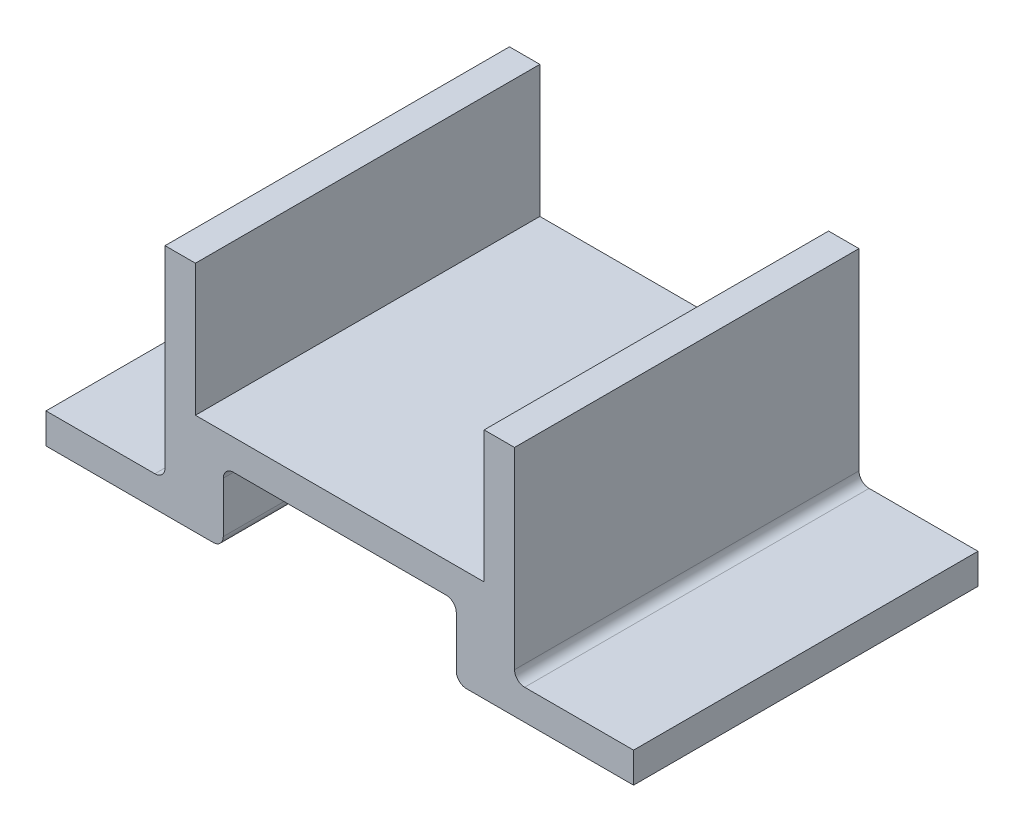
ISO-10303-21;
HEADER;
FILE_DESCRIPTION(('STEP AP214'),'2;1');
FILE_NAME('part.step','',(''),(''),'','','');
FILE_SCHEMA(('AUTOMOTIVE_DESIGN { 1 0 10303 214 1 1 1 1 }'));
ENDSEC;
DATA;
#1=APPLICATION_CONTEXT('core data for automotive mechanical design processes');
#2=APPLICATION_PROTOCOL_DEFINITION('international standard','automotive_design',2000,#1);
#3=PRODUCT_CONTEXT('',#1,'mechanical');
#4=PRODUCT('Part','Part','',(#3));
#5=PRODUCT_RELATED_PRODUCT_CATEGORY('part','',(#4));
#6=PRODUCT_DEFINITION_FORMATION('','',#4);
#7=PRODUCT_DEFINITION_CONTEXT('part definition',#1,'design');
#8=PRODUCT_DEFINITION('design','',#6,#7);
#9=PRODUCT_DEFINITION_SHAPE('','',#8);
#10=(LENGTH_UNIT() NAMED_UNIT(*) SI_UNIT(.MILLI.,.METRE.));
#11=(NAMED_UNIT(*) PLANE_ANGLE_UNIT() SI_UNIT($,.RADIAN.));
#12=(NAMED_UNIT(*) SI_UNIT($,.STERADIAN.) SOLID_ANGLE_UNIT());
#13=UNCERTAINTY_MEASURE_WITH_UNIT(LENGTH_MEASURE(1.E-05),#10,'distance_accuracy_value','');
#14=(GEOMETRIC_REPRESENTATION_CONTEXT(3) GLOBAL_UNCERTAINTY_ASSIGNED_CONTEXT((#13)) GLOBAL_UNIT_ASSIGNED_CONTEXT((#10,
#11,#12)) REPRESENTATION_CONTEXT('',''));
#15=CARTESIAN_POINT('',(0.,0.,0.));
#16=DIRECTION('',(0.,0.,1.));
#17=DIRECTION('',(1.,0.,0.));
#18=AXIS2_PLACEMENT_3D('',#15,#16,#17);
#19=CARTESIAN_POINT('',(0.,10.,0.));
#20=DIRECTION('',(0.,-1.,0.));
#21=DIRECTION('',(0.,0.,-1.));
#22=AXIS2_PLACEMENT_3D('',#19,#20,#21);
#23=PLANE('',#22);
#24=DIRECTION('',(-1.,0.,0.));
#25=VECTOR('',#24,1.);
#26=CARTESIAN_POINT('',(-29.,10.,-17.));
#27=LINE('',#26,#25);
#28=CARTESIAN_POINT('',(14.25,10.,-17.));
#29=VERTEX_POINT('',#28);
#30=CARTESIAN_POINT('',(-14.25,10.,-17.));
#31=VERTEX_POINT('',#30);
#32=EDGE_CURVE('E313',#29,#31,#27,.T.);
#33=ORIENTED_EDGE('',*,*,#32,.T.);
#34=DIRECTION('',(0.,0.,1.));
#35=VECTOR('',#34,1.);
#36=CARTESIAN_POINT('',(-14.25,10.,-17.));
#37=LINE('',#36,#35);
#38=CARTESIAN_POINT('',(-14.25,10.,17.));
#39=VERTEX_POINT('',#38);
#40=EDGE_CURVE('E196',#31,#39,#37,.T.);
#41=ORIENTED_EDGE('',*,*,#40,.T.);
#42=DIRECTION('',(1.,0.,0.));
#43=VECTOR('',#42,1.);
#44=CARTESIAN_POINT('',(-29.,10.,17.));
#45=LINE('',#44,#43);
#46=CARTESIAN_POINT('',(14.25,10.,17.));
#47=VERTEX_POINT('',#46);
#48=EDGE_CURVE('E316',#39,#47,#45,.T.);
#49=ORIENTED_EDGE('',*,*,#48,.T.);
#50=DIRECTION('',(0.,0.,1.));
#51=VECTOR('',#50,1.);
#52=CARTESIAN_POINT('',(14.25,10.,-17.));
#53=LINE('',#52,#51);
#54=EDGE_CURVE('E200',#29,#47,#53,.T.);
#55=ORIENTED_EDGE('',*,*,#54,.F.);
#56=EDGE_LOOP('',(#33,#41,#49,#55));
#57=FACE_BOUND('',#56,.T.);
#58=ADVANCED_FACE('F38',(#57),#23,.F.);
#59=CARTESIAN_POINT('',(-29.,10.,-17.));
#60=DIRECTION('',(0.,0.,1.));
#61=DIRECTION('',(1.,0.,0.));
#62=AXIS2_PLACEMENT_3D('',#59,#60,#61);
#63=PLANE('',#62);
#64=DIRECTION('',(0.,1.,0.));
#65=VECTOR('',#64,1.);
#66=CARTESIAN_POINT('',(-11.5,7.,-17.));
#67=LINE('',#66,#65);
#68=CARTESIAN_POINT('',(-11.5,0.999999999999999,-17.));
#69=VERTEX_POINT('',#68);
#70=CARTESIAN_POINT('',(-11.5,6.,-17.));
#71=VERTEX_POINT('',#70);
#72=EDGE_CURVE('E299',#69,#71,#67,.T.);
#73=ORIENTED_EDGE('',*,*,#72,.F.);
#74=CARTESIAN_POINT('',(-12.5,1.,-17.));
#75=DIRECTION('',(0.,0.,1.));
#76=DIRECTION('',(1.,0.,0.));
#77=AXIS2_PLACEMENT_3D('',#74,#75,#76);
#78=CIRCLE('',#77,1.);
#79=CARTESIAN_POINT('',(-12.5,0.,-17.));
#80=VERTEX_POINT('',#79);
#81=EDGE_CURVE('E370',#69,#80,#78,.F.);
#82=ORIENTED_EDGE('',*,*,#81,.T.);
#83=DIRECTION('',(-1.,0.,0.));
#84=VECTOR('',#83,1.);
#85=CARTESIAN_POINT('',(-29.,0.,-17.));
#86=LINE('',#85,#84);
#87=CARTESIAN_POINT('',(-29.,0.,-17.));
#88=VERTEX_POINT('',#87);
#89=EDGE_CURVE('E324',#80,#88,#86,.T.);
#90=ORIENTED_EDGE('',*,*,#89,.T.);
#91=DIRECTION('',(0.,-1.,0.));
#92=VECTOR('',#91,1.);
#93=CARTESIAN_POINT('',(-29.,10.,-17.));
#94=LINE('',#93,#92);
#95=CARTESIAN_POINT('',(-29.,3.,-17.));
#96=VERTEX_POINT('',#95);
#97=EDGE_CURVE('E343',#96,#88,#94,.T.);
#98=ORIENTED_EDGE('',*,*,#97,.F.);
#99=DIRECTION('',(1.,0.,0.));
#100=VECTOR('',#99,1.);
#101=CARTESIAN_POINT('',(-17.25,3.,-17.));
#102=LINE('',#101,#100);
#103=CARTESIAN_POINT('',(-18.25,3.,-17.));
#104=VERTEX_POINT('',#103);
#105=EDGE_CURVE('E256',#96,#104,#102,.T.);
#106=ORIENTED_EDGE('',*,*,#105,.T.);
#107=CARTESIAN_POINT('',(-18.25,4.,-17.));
#108=DIRECTION('',(0.,0.,1.));
#109=DIRECTION('',(1.,0.,0.));
#110=AXIS2_PLACEMENT_3D('',#107,#108,#109);
#111=CIRCLE('',#110,1.);
#112=CARTESIAN_POINT('',(-17.25,4.,-17.));
#113=VERTEX_POINT('',#112);
#114=EDGE_CURVE('E11',#104,#113,#111,.T.);
#115=ORIENTED_EDGE('',*,*,#114,.T.);
#116=DIRECTION('',(0.,1.,0.));
#117=VECTOR('',#116,1.);
#118=CARTESIAN_POINT('',(-17.25,10.,-17.));
#119=LINE('',#118,#117);
#120=CARTESIAN_POINT('',(-17.25,23.,-17.));
#121=VERTEX_POINT('',#120);
#122=EDGE_CURVE('E216',#113,#121,#119,.T.);
#123=ORIENTED_EDGE('',*,*,#122,.T.);
#124=DIRECTION('',(1.,0.,0.));
#125=VECTOR('',#124,1.);
#126=CARTESIAN_POINT('',(-14.25,23.,-17.));
#127=LINE('',#126,#125);
#128=CARTESIAN_POINT('',(-14.25,23.,-17.));
#129=VERTEX_POINT('',#128);
#130=EDGE_CURVE('E207',#121,#129,#127,.T.);
#131=ORIENTED_EDGE('',*,*,#130,.T.);
#132=DIRECTION('',(0.,-1.,0.));
#133=VECTOR('',#132,1.);
#134=CARTESIAN_POINT('',(-14.25,23.,-17.));
#135=LINE('',#134,#133);
#136=EDGE_CURVE('E190',#129,#31,#135,.T.);
#137=ORIENTED_EDGE('',*,*,#136,.T.);
#138=ORIENTED_EDGE('',*,*,#32,.F.);
#139=DIRECTION('',(0.,-1.,0.));
#140=VECTOR('',#139,1.);
#141=CARTESIAN_POINT('',(14.25,23.,-17.));
#142=LINE('',#141,#140);
#143=CARTESIAN_POINT('',(14.25,23.,-17.));
#144=VERTEX_POINT('',#143);
#145=EDGE_CURVE('E244',#144,#29,#142,.T.);
#146=ORIENTED_EDGE('',*,*,#145,.F.);
#147=DIRECTION('',(-1.,0.,0.));
#148=VECTOR('',#147,1.);
#149=CARTESIAN_POINT('',(14.25,23.,-17.));
#150=LINE('',#149,#148);
#151=CARTESIAN_POINT('',(17.25,23.,-17.));
#152=VERTEX_POINT('',#151);
#153=EDGE_CURVE('E241',#152,#144,#150,.T.);
#154=ORIENTED_EDGE('',*,*,#153,.F.);
#155=DIRECTION('',(0.,1.,0.));
#156=VECTOR('',#155,1.);
#157=CARTESIAN_POINT('',(17.25,10.,-17.));
#158=LINE('',#157,#156);
#159=CARTESIAN_POINT('',(17.25,4.,-17.));
#160=VERTEX_POINT('',#159);
#161=EDGE_CURVE('E273',#160,#152,#158,.T.);
#162=ORIENTED_EDGE('',*,*,#161,.F.);
#163=CARTESIAN_POINT('',(18.25,4.,-17.));
#164=DIRECTION('',(0.,0.,1.));
#165=DIRECTION('',(1.,0.,0.));
#166=AXIS2_PLACEMENT_3D('',#163,#164,#165);
#167=CIRCLE('',#166,1.);
#168=CARTESIAN_POINT('',(18.25,3.,-17.));
#169=VERTEX_POINT('',#168);
#170=EDGE_CURVE('E417',#160,#169,#167,.T.);
#171=ORIENTED_EDGE('',*,*,#170,.T.);
#172=DIRECTION('',(-1.,0.,0.));
#173=VECTOR('',#172,1.);
#174=CARTESIAN_POINT('',(17.25,3.,-17.));
#175=LINE('',#174,#173);
#176=CARTESIAN_POINT('',(29.,3.,-17.));
#177=VERTEX_POINT('',#176);
#178=EDGE_CURVE('E276',#177,#169,#175,.T.);
#179=ORIENTED_EDGE('',*,*,#178,.F.);
#180=DIRECTION('',(0.,-1.,0.));
#181=VECTOR('',#180,1.);
#182=CARTESIAN_POINT('',(29.,10.,-17.));
#183=LINE('',#182,#181);
#184=CARTESIAN_POINT('',(29.,0.,-17.));
#185=VERTEX_POINT('',#184);
#186=EDGE_CURVE('E347',#177,#185,#183,.T.);
#187=ORIENTED_EDGE('',*,*,#186,.T.);
#188=CARTESIAN_POINT('',(12.5,0.,-17.));
#189=VERTEX_POINT('',#188);
#190=EDGE_CURVE('E325',#185,#189,#86,.T.);
#191=ORIENTED_EDGE('',*,*,#190,.T.);
#192=CARTESIAN_POINT('',(12.5,1.,-17.));
#193=DIRECTION('',(0.,0.,1.));
#194=DIRECTION('',(1.,0.,0.));
#195=AXIS2_PLACEMENT_3D('',#192,#193,#194);
#196=CIRCLE('',#195,1.);
#197=CARTESIAN_POINT('',(11.5,1.,-17.));
#198=VERTEX_POINT('',#197);
#199=EDGE_CURVE('E367',#189,#198,#196,.F.);
#200=ORIENTED_EDGE('',*,*,#199,.T.);
#201=DIRECTION('',(0.,-1.,0.));
#202=VECTOR('',#201,1.);
#203=CARTESIAN_POINT('',(11.5,7.,-17.));
#204=LINE('',#203,#202);
#205=CARTESIAN_POINT('',(11.5,6.,-17.));
#206=VERTEX_POINT('',#205);
#207=EDGE_CURVE('E291',#206,#198,#204,.T.);
#208=ORIENTED_EDGE('',*,*,#207,.F.);
#209=CARTESIAN_POINT('',(10.5,6.,-17.));
#210=DIRECTION('',(0.,0.,1.));
#211=DIRECTION('',(1.,0.,0.));
#212=AXIS2_PLACEMENT_3D('',#209,#210,#211);
#213=CIRCLE('',#212,1.);
#214=CARTESIAN_POINT('',(10.5,7.,-17.));
#215=VERTEX_POINT('',#214);
#216=EDGE_CURVE('E54',#206,#215,#213,.T.);
#217=ORIENTED_EDGE('',*,*,#216,.T.);
#218=DIRECTION('',(1.,0.,0.));
#219=VECTOR('',#218,1.);
#220=CARTESIAN_POINT('',(-11.5,7.,-17.));
#221=LINE('',#220,#219);
#222=CARTESIAN_POINT('',(-10.5,7.,-17.));
#223=VERTEX_POINT('',#222);
#224=EDGE_CURVE('E295',#223,#215,#221,.T.);
#225=ORIENTED_EDGE('',*,*,#224,.F.);
#226=CARTESIAN_POINT('',(-10.5,6.,-17.));
#227=DIRECTION('',(0.,0.,1.));
#228=DIRECTION('',(1.,0.,0.));
#229=AXIS2_PLACEMENT_3D('',#226,#227,#228);
#230=CIRCLE('',#229,1.);
#231=EDGE_CURVE('E411',#223,#71,#230,.T.);
#232=ORIENTED_EDGE('',*,*,#231,.T.);
#233=EDGE_LOOP('',(#73,#82,#90,#98,#106,#115,#123,#131,#137,#138,#146,#154,#162,#171,#179,#187,
#191,#200,#208,#217,#225,#232));
#234=FACE_BOUND('',#233,.T.);
#235=ADVANCED_FACE('F214',(#234),#63,.F.);
#236=CARTESIAN_POINT('',(-29.,10.,17.));
#237=DIRECTION('',(1.,0.,0.));
#238=DIRECTION('',(0.,0.,-1.));
#239=AXIS2_PLACEMENT_3D('',#236,#237,#238);
#240=PLANE('',#239);
#241=DIRECTION('',(0.,0.,1.));
#242=VECTOR('',#241,1.);
#243=CARTESIAN_POINT('',(-29.,3.,-30.6770793665899));
#244=LINE('',#243,#242);
#245=CARTESIAN_POINT('',(-29.,3.,17.));
#246=VERTEX_POINT('',#245);
#247=EDGE_CURVE('E260',#96,#246,#244,.T.);
#248=ORIENTED_EDGE('',*,*,#247,.F.);
#249=ORIENTED_EDGE('',*,*,#97,.T.);
#250=DIRECTION('',(0.,0.,1.));
#251=VECTOR('',#250,1.);
#252=CARTESIAN_POINT('',(-29.,0.,17.));
#253=LINE('',#252,#251);
#254=CARTESIAN_POINT('',(-29.,0.,17.));
#255=VERTEX_POINT('',#254);
#256=EDGE_CURVE('E329',#88,#255,#253,.T.);
#257=ORIENTED_EDGE('',*,*,#256,.T.);
#258=DIRECTION('',(0.,-1.,0.));
#259=VECTOR('',#258,1.);
#260=CARTESIAN_POINT('',(-29.,10.,17.));
#261=LINE('',#260,#259);
#262=EDGE_CURVE('E340',#246,#255,#261,.T.);
#263=ORIENTED_EDGE('',*,*,#262,.F.);
#264=EDGE_LOOP('',(#248,#249,#257,#263));
#265=FACE_BOUND('',#264,.T.);
#266=ADVANCED_FACE('F499',(#265),#240,.F.);
#267=CARTESIAN_POINT('',(-29.,10.,17.));
#268=DIRECTION('',(0.,0.,-1.));
#269=DIRECTION('',(-1.,0.,0.));
#270=AXIS2_PLACEMENT_3D('',#267,#268,#269);
#271=PLANE('',#270);
#272=DIRECTION('',(1.,0.,0.));
#273=VECTOR('',#272,1.);
#274=CARTESIAN_POINT('',(-29.,0.,17.));
#275=LINE('',#274,#273);
#276=CARTESIAN_POINT('',(-12.5,0.,17.));
#277=VERTEX_POINT('',#276);
#278=EDGE_CURVE('E317',#255,#277,#275,.T.);
#279=ORIENTED_EDGE('',*,*,#278,.T.);
#280=CARTESIAN_POINT('',(-12.5,1.,17.));
#281=DIRECTION('',(0.,0.,-1.));
#282=DIRECTION('',(-1.,0.,0.));
#283=AXIS2_PLACEMENT_3D('',#280,#281,#282);
#284=CIRCLE('',#283,1.);
#285=CARTESIAN_POINT('',(-11.5,0.999999999999999,17.));
#286=VERTEX_POINT('',#285);
#287=EDGE_CURVE('E357',#277,#286,#284,.F.);
#288=ORIENTED_EDGE('',*,*,#287,.T.);
#289=DIRECTION('',(0.,-1.,0.));
#290=VECTOR('',#289,1.);
#291=CARTESIAN_POINT('',(-11.5,7.,17.));
#292=LINE('',#291,#290);
#293=CARTESIAN_POINT('',(-11.5,6.,17.));
#294=VERTEX_POINT('',#293);
#295=EDGE_CURVE('E290',#294,#286,#292,.T.);
#296=ORIENTED_EDGE('',*,*,#295,.F.);
#297=CARTESIAN_POINT('',(-10.5,6.,17.));
#298=DIRECTION('',(0.,0.,-1.));
#299=DIRECTION('',(-1.,0.,0.));
#300=AXIS2_PLACEMENT_3D('',#297,#298,#299);
#301=CIRCLE('',#300,1.);
#302=CARTESIAN_POINT('',(-10.5,7.,17.));
#303=VERTEX_POINT('',#302);
#304=EDGE_CURVE('E408',#294,#303,#301,.T.);
#305=ORIENTED_EDGE('',*,*,#304,.T.);
#306=DIRECTION('',(-1.,0.,0.));
#307=VECTOR('',#306,1.);
#308=CARTESIAN_POINT('',(-11.5,7.,17.));
#309=LINE('',#308,#307);
#310=CARTESIAN_POINT('',(10.5,7.,17.));
#311=VERTEX_POINT('',#310);
#312=EDGE_CURVE('E296',#311,#303,#309,.T.);
#313=ORIENTED_EDGE('',*,*,#312,.F.);
#314=CARTESIAN_POINT('',(10.5,6.,17.));
#315=DIRECTION('',(0.,0.,-1.));
#316=DIRECTION('',(-1.,0.,0.));
#317=AXIS2_PLACEMENT_3D('',#314,#315,#316);
#318=CIRCLE('',#317,1.);
#319=CARTESIAN_POINT('',(11.5,6.,17.));
#320=VERTEX_POINT('',#319);
#321=EDGE_CURVE('E403',#311,#320,#318,.T.);
#322=ORIENTED_EDGE('',*,*,#321,.T.);
#323=DIRECTION('',(0.,1.,0.));
#324=VECTOR('',#323,1.);
#325=CARTESIAN_POINT('',(11.5,7.,17.));
#326=LINE('',#325,#324);
#327=CARTESIAN_POINT('',(11.5,1.,17.));
#328=VERTEX_POINT('',#327);
#329=EDGE_CURVE('E307',#328,#320,#326,.T.);
#330=ORIENTED_EDGE('',*,*,#329,.F.);
#331=CARTESIAN_POINT('',(12.5,1.,17.));
#332=DIRECTION('',(0.,0.,-1.));
#333=DIRECTION('',(-1.,0.,0.));
#334=AXIS2_PLACEMENT_3D('',#331,#332,#333);
#335=CIRCLE('',#334,1.);
#336=CARTESIAN_POINT('',(12.5,0.,17.));
#337=VERTEX_POINT('',#336);
#338=EDGE_CURVE('E354',#328,#337,#335,.F.);
#339=ORIENTED_EDGE('',*,*,#338,.T.);
#340=CARTESIAN_POINT('',(29.,0.,17.));
#341=VERTEX_POINT('',#340);
#342=EDGE_CURVE('E333',#337,#341,#275,.T.);
#343=ORIENTED_EDGE('',*,*,#342,.T.);
#344=DIRECTION('',(0.,-1.,0.));
#345=VECTOR('',#344,1.);
#346=CARTESIAN_POINT('',(29.,10.,17.));
#347=LINE('',#346,#345);
#348=CARTESIAN_POINT('',(29.,3.,17.));
#349=VERTEX_POINT('',#348);
#350=EDGE_CURVE('E320',#349,#341,#347,.T.);
#351=ORIENTED_EDGE('',*,*,#350,.F.);
#352=DIRECTION('',(1.,0.,0.));
#353=VECTOR('',#352,1.);
#354=CARTESIAN_POINT('',(17.25,3.,17.));
#355=LINE('',#354,#353);
#356=CARTESIAN_POINT('',(18.25,3.,17.));
#357=VERTEX_POINT('',#356);
#358=EDGE_CURVE('E281',#357,#349,#355,.T.);
#359=ORIENTED_EDGE('',*,*,#358,.F.);
#360=CARTESIAN_POINT('',(18.25,4.,17.));
#361=DIRECTION('',(0.,0.,-1.));
#362=DIRECTION('',(-1.,0.,0.));
#363=AXIS2_PLACEMENT_3D('',#360,#361,#362);
#364=CIRCLE('',#363,1.);
#365=CARTESIAN_POINT('',(17.25,4.,17.));
#366=VERTEX_POINT('',#365);
#367=EDGE_CURVE('E414',#357,#366,#364,.T.);
#368=ORIENTED_EDGE('',*,*,#367,.T.);
#369=DIRECTION('',(0.,-1.,0.));
#370=VECTOR('',#369,1.);
#371=CARTESIAN_POINT('',(17.25,10.,17.));
#372=LINE('',#371,#370);
#373=CARTESIAN_POINT('',(17.25,23.,17.));
#374=VERTEX_POINT('',#373);
#375=EDGE_CURVE('E263',#374,#366,#372,.T.);
#376=ORIENTED_EDGE('',*,*,#375,.F.);
#377=DIRECTION('',(1.,0.,0.));
#378=VECTOR('',#377,1.);
#379=CARTESIAN_POINT('',(14.25,23.,17.));
#380=LINE('',#379,#378);
#381=CARTESIAN_POINT('',(14.25,23.,17.));
#382=VERTEX_POINT('',#381);
#383=EDGE_CURVE('E233',#382,#374,#380,.T.);
#384=ORIENTED_EDGE('',*,*,#383,.F.);
#385=DIRECTION('',(0.,-1.,0.));
#386=VECTOR('',#385,1.);
#387=CARTESIAN_POINT('',(14.25,23.,17.));
#388=LINE('',#387,#386);
#389=EDGE_CURVE('E251',#382,#47,#388,.T.);
#390=ORIENTED_EDGE('',*,*,#389,.T.);
#391=ORIENTED_EDGE('',*,*,#48,.F.);
#392=DIRECTION('',(0.,-1.,0.));
#393=VECTOR('',#392,1.);
#394=CARTESIAN_POINT('',(-14.25,23.,17.));
#395=LINE('',#394,#393);
#396=CARTESIAN_POINT('',(-14.25,23.,17.));
#397=VERTEX_POINT('',#396);
#398=EDGE_CURVE('E201',#397,#39,#395,.T.);
#399=ORIENTED_EDGE('',*,*,#398,.F.);
#400=DIRECTION('',(-1.,0.,0.));
#401=VECTOR('',#400,1.);
#402=CARTESIAN_POINT('',(-14.25,23.,17.));
#403=LINE('',#402,#401);
#404=CARTESIAN_POINT('',(-17.25,23.,17.));
#405=VERTEX_POINT('',#404);
#406=EDGE_CURVE('E210',#397,#405,#403,.T.);
#407=ORIENTED_EDGE('',*,*,#406,.T.);
#408=DIRECTION('',(0.,-1.,0.));
#409=VECTOR('',#408,1.);
#410=CARTESIAN_POINT('',(-17.25,10.,17.));
#411=LINE('',#410,#409);
#412=CARTESIAN_POINT('',(-17.25,4.,17.));
#413=VERTEX_POINT('',#412);
#414=EDGE_CURVE('E255',#405,#413,#411,.T.);
#415=ORIENTED_EDGE('',*,*,#414,.T.);
#416=CARTESIAN_POINT('',(-18.25,4.,17.));
#417=DIRECTION('',(0.,0.,-1.));
#418=DIRECTION('',(-1.,0.,0.));
#419=AXIS2_PLACEMENT_3D('',#416,#417,#418);
#420=CIRCLE('',#419,1.);
#421=CARTESIAN_POINT('',(-18.25,3.,17.));
#422=VERTEX_POINT('',#421);
#423=EDGE_CURVE('E47',#413,#422,#420,.T.);
#424=ORIENTED_EDGE('',*,*,#423,.T.);
#425=DIRECTION('',(-1.,0.,0.));
#426=VECTOR('',#425,1.);
#427=CARTESIAN_POINT('',(-17.25,3.,17.));
#428=LINE('',#427,#426);
#429=EDGE_CURVE('E267',#422,#246,#428,.T.);
#430=ORIENTED_EDGE('',*,*,#429,.T.);
#431=ORIENTED_EDGE('',*,*,#262,.T.);
#432=EDGE_LOOP('',(#279,#288,#296,#305,#313,#322,#330,#339,#343,#351,#359,#368,#376,#384,#390,
#391,#399,#407,#415,#424,#430,#431));
#433=FACE_BOUND('',#432,.T.);
#434=ADVANCED_FACE('F422',(#433),#271,.F.);
#435=CARTESIAN_POINT('',(0.,0.,0.));
#436=DIRECTION('',(0.,-1.,0.));
#437=DIRECTION('',(0.,0.,-1.));
#438=AXIS2_PLACEMENT_3D('',#435,#436,#437);
#439=PLANE('',#438);
#440=ORIENTED_EDGE('',*,*,#89,.F.);
#441=DIRECTION('',(0.,0.,1.));
#442=VECTOR('',#441,1.);
#443=CARTESIAN_POINT('',(-12.5,0.,17.));
#444=LINE('',#443,#442);
#445=EDGE_CURVE('E350',#80,#277,#444,.T.);
#446=ORIENTED_EDGE('',*,*,#445,.T.);
#447=ORIENTED_EDGE('',*,*,#278,.F.);
#448=ORIENTED_EDGE('',*,*,#256,.F.);
#449=EDGE_LOOP('',(#440,#446,#447,#448));
#450=FACE_BOUND('',#449,.T.);
#451=ADVANCED_FACE('F494',(#450),#439,.T.);
#452=CARTESIAN_POINT('',(29.,10.,17.));
#453=DIRECTION('',(-1.,0.,0.));
#454=DIRECTION('',(0.,0.,1.));
#455=AXIS2_PLACEMENT_3D('',#452,#453,#454);
#456=PLANE('',#455);
#457=ORIENTED_EDGE('',*,*,#186,.F.);
#458=DIRECTION('',(0.,0.,1.));
#459=VECTOR('',#458,1.);
#460=CARTESIAN_POINT('',(29.,3.,-30.6770793665899));
#461=LINE('',#460,#459);
#462=EDGE_CURVE('E277',#177,#349,#461,.T.);
#463=ORIENTED_EDGE('',*,*,#462,.T.);
#464=ORIENTED_EDGE('',*,*,#350,.T.);
#465=DIRECTION('',(0.,0.,-1.));
#466=VECTOR('',#465,1.);
#467=CARTESIAN_POINT('',(29.,0.,17.));
#468=LINE('',#467,#466);
#469=EDGE_CURVE('E303',#341,#185,#468,.T.);
#470=ORIENTED_EDGE('',*,*,#469,.T.);
#471=EDGE_LOOP('',(#457,#463,#464,#470));
#472=FACE_BOUND('',#471,.T.);
#473=ADVANCED_FACE('F461',(#472),#456,.F.);
#474=ORIENTED_EDGE('',*,*,#342,.F.);
#475=DIRECTION('',(0.,0.,1.));
#476=VECTOR('',#475,1.);
#477=CARTESIAN_POINT('',(12.5,0.,-17.));
#478=LINE('',#477,#476);
#479=EDGE_CURVE('E380',#337,#189,#478,.F.);
#480=ORIENTED_EDGE('',*,*,#479,.T.);
#481=ORIENTED_EDGE('',*,*,#190,.F.);
#482=ORIENTED_EDGE('',*,*,#469,.F.);
#483=EDGE_LOOP('',(#474,#480,#481,#482));
#484=FACE_BOUND('',#483,.T.);
#485=ADVANCED_FACE('F464',(#484),#439,.T.);
#486=CARTESIAN_POINT('',(-11.5,7.,-41.0416305603426));
#487=DIRECTION('',(-1.,0.,0.));
#488=DIRECTION('',(0.,-1.,0.));
#489=AXIS2_PLACEMENT_3D('',#486,#487,#488);
#490=PLANE('',#489);
#491=ORIENTED_EDGE('',*,*,#295,.T.);
#492=DIRECTION('',(0.,0.,1.));
#493=VECTOR('',#492,1.);
#494=CARTESIAN_POINT('',(-11.5,0.999999999999999,-17.));
#495=LINE('',#494,#493);
#496=EDGE_CURVE('E364',#286,#69,#495,.F.);
#497=ORIENTED_EDGE('',*,*,#496,.T.);
#498=ORIENTED_EDGE('',*,*,#72,.T.);
#499=DIRECTION('',(0.,0.,1.));
#500=VECTOR('',#499,1.);
#501=CARTESIAN_POINT('',(-11.5,6.,17.));
#502=LINE('',#501,#500);
#503=EDGE_CURVE('E360',#71,#294,#502,.T.);
#504=ORIENTED_EDGE('',*,*,#503,.T.);
#505=EDGE_LOOP('',(#491,#497,#498,#504));
#506=FACE_BOUND('',#505,.T.);
#507=ADVANCED_FACE('F485',(#506),#490,.F.);
#508=CARTESIAN_POINT('',(-11.5,7.,-41.0416305603426));
#509=DIRECTION('',(0.,1.,0.));
#510=DIRECTION('',(-1.,0.,0.));
#511=AXIS2_PLACEMENT_3D('',#508,#509,#510);
#512=PLANE('',#511);
#513=ORIENTED_EDGE('',*,*,#224,.T.);
#514=DIRECTION('',(0.,0.,1.));
#515=VECTOR('',#514,1.);
#516=CARTESIAN_POINT('',(10.5,7.,17.));
#517=LINE('',#516,#515);
#518=EDGE_CURVE('E385',#215,#311,#517,.T.);
#519=ORIENTED_EDGE('',*,*,#518,.T.);
#520=ORIENTED_EDGE('',*,*,#312,.T.);
#521=DIRECTION('',(0.,0.,1.));
#522=VECTOR('',#521,1.);
#523=CARTESIAN_POINT('',(-10.5,7.,-17.));
#524=LINE('',#523,#522);
#525=EDGE_CURVE('E61',#303,#223,#524,.F.);
#526=ORIENTED_EDGE('',*,*,#525,.T.);
#527=EDGE_LOOP('',(#513,#519,#520,#526));
#528=FACE_BOUND('',#527,.T.);
#529=ADVANCED_FACE('F478',(#528),#512,.F.);
#530=CARTESIAN_POINT('',(11.5,7.,-41.0416305603426));
#531=DIRECTION('',(1.,0.,0.));
#532=DIRECTION('',(0.,1.,0.));
#533=AXIS2_PLACEMENT_3D('',#530,#531,#532);
#534=PLANE('',#533);
#535=ORIENTED_EDGE('',*,*,#207,.T.);
#536=DIRECTION('',(0.,0.,1.));
#537=VECTOR('',#536,1.);
#538=CARTESIAN_POINT('',(11.5,1.,17.));
#539=LINE('',#538,#537);
#540=EDGE_CURVE('E376',#198,#328,#539,.T.);
#541=ORIENTED_EDGE('',*,*,#540,.T.);
#542=ORIENTED_EDGE('',*,*,#329,.T.);
#543=DIRECTION('',(0.,0.,1.));
#544=VECTOR('',#543,1.);
#545=CARTESIAN_POINT('',(11.5,6.,-17.));
#546=LINE('',#545,#544);
#547=EDGE_CURVE('E373',#320,#206,#546,.F.);
#548=ORIENTED_EDGE('',*,*,#547,.T.);
#549=EDGE_LOOP('',(#535,#541,#542,#548));
#550=FACE_BOUND('',#549,.T.);
#551=ADVANCED_FACE('F472',(#550),#534,.F.);
#552=CARTESIAN_POINT('',(17.25,10.,-30.6770793665899));
#553=DIRECTION('',(-1.,0.,0.));
#554=DIRECTION('',(0.,-1.,0.));
#555=AXIS2_PLACEMENT_3D('',#552,#553,#554);
#556=PLANE('',#555);
#557=ORIENTED_EDGE('',*,*,#375,.T.);
#558=DIRECTION('',(0.,0.,1.));
#559=VECTOR('',#558,1.);
#560=CARTESIAN_POINT('',(17.25,4.,-17.));
#561=LINE('',#560,#559);
#562=EDGE_CURVE('E393',#366,#160,#561,.F.);
#563=ORIENTED_EDGE('',*,*,#562,.T.);
#564=ORIENTED_EDGE('',*,*,#161,.T.);
#565=DIRECTION('',(0.,0.,-1.));
#566=VECTOR('',#565,1.);
#567=CARTESIAN_POINT('',(17.25,23.,-17.));
#568=LINE('',#567,#566);
#569=EDGE_CURVE('E237',#374,#152,#568,.T.);
#570=ORIENTED_EDGE('',*,*,#569,.F.);
#571=EDGE_LOOP('',(#557,#563,#564,#570));
#572=FACE_BOUND('',#571,.T.);
#573=ADVANCED_FACE('F612',(#572),#556,.F.);
#574=CARTESIAN_POINT('',(17.25,3.,-30.6770793665899));
#575=DIRECTION('',(0.,-1.,0.));
#576=DIRECTION('',(0.,0.,-1.));
#577=AXIS2_PLACEMENT_3D('',#574,#575,#576);
#578=PLANE('',#577);
#579=ORIENTED_EDGE('',*,*,#178,.T.);
#580=DIRECTION('',(0.,0.,1.));
#581=VECTOR('',#580,1.);
#582=CARTESIAN_POINT('',(18.25,3.,17.));
#583=LINE('',#582,#581);
#584=EDGE_CURVE('E389',#169,#357,#583,.T.);
#585=ORIENTED_EDGE('',*,*,#584,.T.);
#586=ORIENTED_EDGE('',*,*,#358,.T.);
#587=ORIENTED_EDGE('',*,*,#462,.F.);
#588=EDGE_LOOP('',(#579,#585,#586,#587));
#589=FACE_BOUND('',#588,.T.);
#590=ADVANCED_FACE('F455',(#589),#578,.F.);
#591=CARTESIAN_POINT('',(-17.25,3.,-30.6770793665899));
#592=DIRECTION('',(0.,1.,0.));
#593=DIRECTION('',(0.,0.,1.));
#594=AXIS2_PLACEMENT_3D('',#591,#592,#593);
#595=PLANE('',#594);
#596=ORIENTED_EDGE('',*,*,#429,.F.);
#597=DIRECTION('',(0.,0.,1.));
#598=VECTOR('',#597,1.);
#599=CARTESIAN_POINT('',(-18.25,3.,-17.));
#600=LINE('',#599,#598);
#601=EDGE_CURVE('E400',#422,#104,#600,.F.);
#602=ORIENTED_EDGE('',*,*,#601,.T.);
#603=ORIENTED_EDGE('',*,*,#105,.F.);
#604=ORIENTED_EDGE('',*,*,#247,.T.);
#605=EDGE_LOOP('',(#596,#602,#603,#604));
#606=FACE_BOUND('',#605,.T.);
#607=ADVANCED_FACE('F427',(#606),#595,.T.);
#608=CARTESIAN_POINT('',(-17.25,10.,-30.6770793665899));
#609=DIRECTION('',(-1.,0.,0.));
#610=DIRECTION('',(0.,-1.,0.));
#611=AXIS2_PLACEMENT_3D('',#608,#609,#610);
#612=PLANE('',#611);
#613=ORIENTED_EDGE('',*,*,#122,.F.);
#614=DIRECTION('',(0.,0.,1.));
#615=VECTOR('',#614,1.);
#616=CARTESIAN_POINT('',(-17.25,4.,17.));
#617=LINE('',#616,#615);
#618=EDGE_CURVE('E396',#113,#413,#617,.T.);
#619=ORIENTED_EDGE('',*,*,#618,.T.);
#620=ORIENTED_EDGE('',*,*,#414,.F.);
#621=DIRECTION('',(0.,0.,-1.));
#622=VECTOR('',#621,1.);
#623=CARTESIAN_POINT('',(-17.25,23.,-17.));
#624=LINE('',#623,#622);
#625=EDGE_CURVE('E218',#405,#121,#624,.T.);
#626=ORIENTED_EDGE('',*,*,#625,.T.);
#627=EDGE_LOOP('',(#613,#619,#620,#626));
#628=FACE_BOUND('',#627,.T.);
#629=ADVANCED_FACE('F433',(#628),#612,.T.);
#630=CARTESIAN_POINT('',(14.25,23.,-17.));
#631=DIRECTION('',(1.,0.,0.));
#632=DIRECTION('',(0.,0.,-1.));
#633=AXIS2_PLACEMENT_3D('',#630,#631,#632);
#634=PLANE('',#633);
#635=ORIENTED_EDGE('',*,*,#54,.T.);
#636=ORIENTED_EDGE('',*,*,#389,.F.);
#637=DIRECTION('',(0.,0.,1.));
#638=VECTOR('',#637,1.);
#639=CARTESIAN_POINT('',(14.25,23.,-17.));
#640=LINE('',#639,#638);
#641=EDGE_CURVE('E229',#144,#382,#640,.T.);
#642=ORIENTED_EDGE('',*,*,#641,.F.);
#643=ORIENTED_EDGE('',*,*,#145,.T.);
#644=EDGE_LOOP('',(#635,#636,#642,#643));
#645=FACE_BOUND('',#644,.T.);
#646=ADVANCED_FACE('F441',(#645),#634,.F.);
#647=CARTESIAN_POINT('',(0.,23.,0.));
#648=DIRECTION('',(0.,1.,0.));
#649=DIRECTION('',(0.,0.,1.));
#650=AXIS2_PLACEMENT_3D('',#647,#648,#649);
#651=PLANE('',#650);
#652=ORIENTED_EDGE('',*,*,#641,.T.);
#653=ORIENTED_EDGE('',*,*,#383,.T.);
#654=ORIENTED_EDGE('',*,*,#569,.T.);
#655=ORIENTED_EDGE('',*,*,#153,.T.);
#656=EDGE_LOOP('',(#652,#653,#654,#655));
#657=FACE_BOUND('',#656,.T.);
#658=ADVANCED_FACE('F443',(#657),#651,.T.);
#659=CARTESIAN_POINT('',(-14.25,23.,-17.));
#660=DIRECTION('',(1.,0.,0.));
#661=DIRECTION('',(0.,0.,-1.));
#662=AXIS2_PLACEMENT_3D('',#659,#660,#661);
#663=PLANE('',#662);
#664=ORIENTED_EDGE('',*,*,#40,.F.);
#665=ORIENTED_EDGE('',*,*,#136,.F.);
#666=DIRECTION('',(0.,0.,1.));
#667=VECTOR('',#666,1.);
#668=CARTESIAN_POINT('',(-14.25,23.,-17.));
#669=LINE('',#668,#667);
#670=EDGE_CURVE('E194',#129,#397,#669,.T.);
#671=ORIENTED_EDGE('',*,*,#670,.T.);
#672=ORIENTED_EDGE('',*,*,#398,.T.);
#673=EDGE_LOOP('',(#664,#665,#671,#672));
#674=FACE_BOUND('',#673,.T.);
#675=ADVANCED_FACE('F192',(#674),#663,.T.);
#676=CARTESIAN_POINT('',(0.,23.,0.));
#677=DIRECTION('',(0.,1.,0.));
#678=DIRECTION('',(0.,0.,1.));
#679=AXIS2_PLACEMENT_3D('',#676,#677,#678);
#680=PLANE('',#679);
#681=ORIENTED_EDGE('',*,*,#670,.F.);
#682=ORIENTED_EDGE('',*,*,#130,.F.);
#683=ORIENTED_EDGE('',*,*,#625,.F.);
#684=ORIENTED_EDGE('',*,*,#406,.F.);
#685=EDGE_LOOP('',(#681,#682,#683,#684));
#686=FACE_BOUND('',#685,.T.);
#687=ADVANCED_FACE('F205',(#686),#680,.T.);
#688=CARTESIAN_POINT('',(-12.5,1.,0.));
#689=DIRECTION('',(0.,0.,-1.));
#690=DIRECTION('',(-1.,0.,0.));
#691=AXIS2_PLACEMENT_3D('',#688,#689,#690);
#692=CYLINDRICAL_SURFACE('',#691,1.);
#693=ORIENTED_EDGE('',*,*,#81,.F.);
#694=ORIENTED_EDGE('',*,*,#496,.F.);
#695=ORIENTED_EDGE('',*,*,#287,.F.);
#696=ORIENTED_EDGE('',*,*,#445,.F.);
#697=EDGE_LOOP('',(#693,#694,#695,#696));
#698=FACE_BOUND('',#697,.T.);
#699=ADVANCED_FACE('F491',(#698),#692,.T.);
#700=CARTESIAN_POINT('',(12.5,1.,-41.0416305603426));
#701=DIRECTION('',(0.,0.,-1.));
#702=DIRECTION('',(-1.,0.,0.));
#703=AXIS2_PLACEMENT_3D('',#700,#701,#702);
#704=CYLINDRICAL_SURFACE('',#703,1.);
#705=ORIENTED_EDGE('',*,*,#199,.F.);
#706=ORIENTED_EDGE('',*,*,#479,.F.);
#707=ORIENTED_EDGE('',*,*,#338,.F.);
#708=ORIENTED_EDGE('',*,*,#540,.F.);
#709=EDGE_LOOP('',(#705,#706,#707,#708));
#710=FACE_BOUND('',#709,.T.);
#711=ADVANCED_FACE('F469',(#710),#704,.T.);
#712=CARTESIAN_POINT('',(10.5,6.,-41.0416305603426));
#713=DIRECTION('',(0.,0.,-1.));
#714=DIRECTION('',(-1.,0.,0.));
#715=AXIS2_PLACEMENT_3D('',#712,#713,#714);
#716=CYLINDRICAL_SURFACE('',#715,1.);
#717=ORIENTED_EDGE('',*,*,#216,.F.);
#718=ORIENTED_EDGE('',*,*,#547,.F.);
#719=ORIENTED_EDGE('',*,*,#321,.F.);
#720=ORIENTED_EDGE('',*,*,#518,.F.);
#721=EDGE_LOOP('',(#717,#718,#719,#720));
#722=FACE_BOUND('',#721,.T.);
#723=ADVANCED_FACE('F477',(#722),#716,.F.);
#724=CARTESIAN_POINT('',(-10.5,6.,-41.0416305603426));
#725=DIRECTION('',(0.,0.,-1.));
#726=DIRECTION('',(-1.,0.,0.));
#727=AXIS2_PLACEMENT_3D('',#724,#725,#726);
#728=CYLINDRICAL_SURFACE('',#727,1.);
#729=ORIENTED_EDGE('',*,*,#231,.F.);
#730=ORIENTED_EDGE('',*,*,#525,.F.);
#731=ORIENTED_EDGE('',*,*,#304,.F.);
#732=ORIENTED_EDGE('',*,*,#503,.F.);
#733=EDGE_LOOP('',(#729,#730,#731,#732));
#734=FACE_BOUND('',#733,.T.);
#735=ADVANCED_FACE('F482',(#734),#728,.F.);
#736=CARTESIAN_POINT('',(18.25,4.,-30.6770793665899));
#737=DIRECTION('',(0.,0.,-1.));
#738=DIRECTION('',(-1.,0.,0.));
#739=AXIS2_PLACEMENT_3D('',#736,#737,#738);
#740=CYLINDRICAL_SURFACE('',#739,1.);
#741=ORIENTED_EDGE('',*,*,#170,.F.);
#742=ORIENTED_EDGE('',*,*,#562,.F.);
#743=ORIENTED_EDGE('',*,*,#367,.F.);
#744=ORIENTED_EDGE('',*,*,#584,.F.);
#745=EDGE_LOOP('',(#741,#742,#743,#744));
#746=FACE_BOUND('',#745,.T.);
#747=ADVANCED_FACE('F452',(#746),#740,.F.);
#748=CARTESIAN_POINT('',(-18.25,4.,-30.6770793665899));
#749=DIRECTION('',(0.,0.,-1.));
#750=DIRECTION('',(-1.,0.,0.));
#751=AXIS2_PLACEMENT_3D('',#748,#749,#750);
#752=CYLINDRICAL_SURFACE('',#751,1.);
#753=ORIENTED_EDGE('',*,*,#114,.F.);
#754=ORIENTED_EDGE('',*,*,#601,.F.);
#755=ORIENTED_EDGE('',*,*,#423,.F.);
#756=ORIENTED_EDGE('',*,*,#618,.F.);
#757=EDGE_LOOP('',(#753,#754,#755,#756));
#758=FACE_BOUND('',#757,.T.);
#759=ADVANCED_FACE('F40',(#758),#752,.F.);
#760=CLOSED_SHELL('',(#58,#235,#266,#434,#451,#473,#485,#507,#529,#551,#573,#590,#607,#629,#646,
#658,#675,#687,#699,#711,#723,#735,#747,#759));
#761=MANIFOLD_SOLID_BREP('B2',#760);
#762=ADVANCED_BREP_SHAPE_REPRESENTATION('',(#18,#761),#14);
#763=SHAPE_DEFINITION_REPRESENTATION(#9,#762);
ENDSEC;
END-ISO-10303-21;
